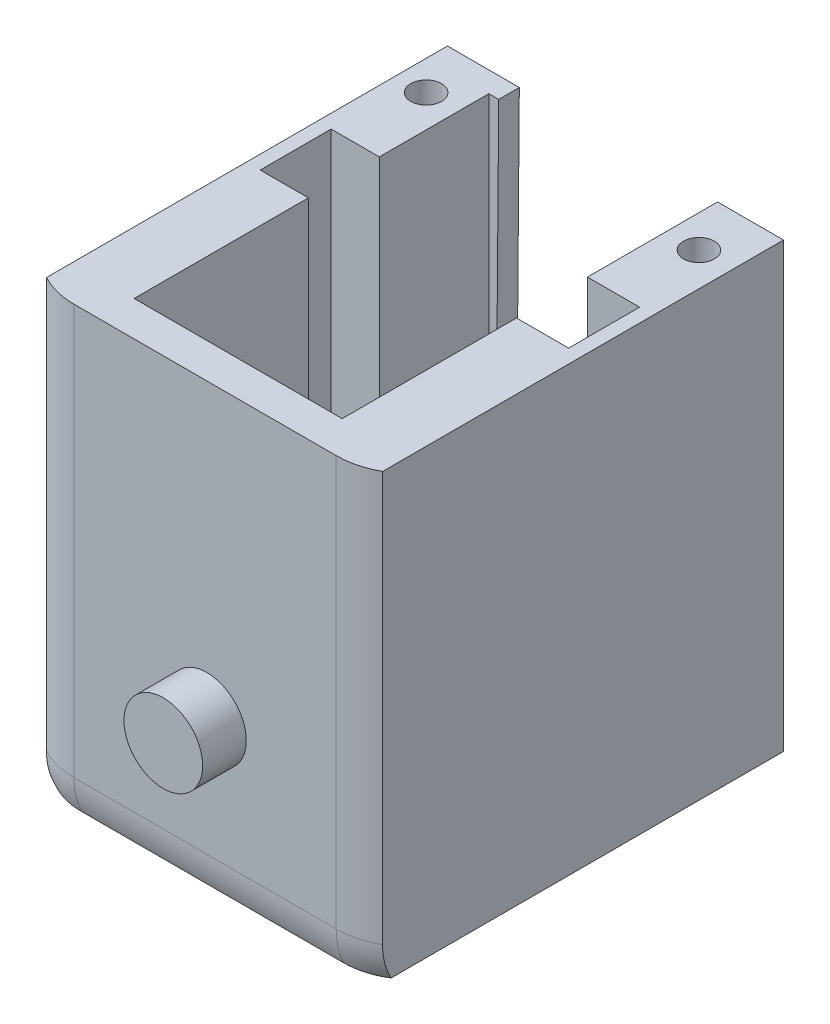
ISO-10303-21;
HEADER;
FILE_DESCRIPTION(('STEP AP214'),'2;1');
FILE_NAME('part.step','',(''),(''),'','','');
FILE_SCHEMA(('AUTOMOTIVE_DESIGN { 1 0 10303 214 1 1 1 1 }'));
ENDSEC;
DATA;
#1=APPLICATION_CONTEXT('core data for automotive mechanical design processes');
#2=APPLICATION_PROTOCOL_DEFINITION('international standard','automotive_design',2000,#1);
#3=PRODUCT_CONTEXT('',#1,'mechanical');
#4=PRODUCT('Part','Part','',(#3));
#5=PRODUCT_RELATED_PRODUCT_CATEGORY('part','',(#4));
#6=PRODUCT_DEFINITION_FORMATION('','',#4);
#7=PRODUCT_DEFINITION_CONTEXT('part definition',#1,'design');
#8=PRODUCT_DEFINITION('design','',#6,#7);
#9=PRODUCT_DEFINITION_SHAPE('','',#8);
#10=(LENGTH_UNIT() NAMED_UNIT(*) SI_UNIT(.MILLI.,.METRE.));
#11=(NAMED_UNIT(*) PLANE_ANGLE_UNIT() SI_UNIT($,.RADIAN.));
#12=(NAMED_UNIT(*) SI_UNIT($,.STERADIAN.) SOLID_ANGLE_UNIT());
#13=UNCERTAINTY_MEASURE_WITH_UNIT(LENGTH_MEASURE(1.E-05),#10,'distance_accuracy_value','');
#14=(GEOMETRIC_REPRESENTATION_CONTEXT(3) GLOBAL_UNCERTAINTY_ASSIGNED_CONTEXT((#13)) GLOBAL_UNIT_ASSIGNED_CONTEXT((#10,
#11,#12)) REPRESENTATION_CONTEXT('',''));
#15=CARTESIAN_POINT('',(0.,0.,0.));
#16=DIRECTION('',(0.,0.,1.));
#17=DIRECTION('',(1.,0.,0.));
#18=AXIS2_PLACEMENT_3D('',#15,#16,#17);
#19=CARTESIAN_POINT('',(13.6189073583087,13.8874822670605,-22.));
#20=DIRECTION('',(0.,0.,-1.));
#21=DIRECTION('',(-1.,0.,0.));
#22=AXIS2_PLACEMENT_3D('',#19,#20,#21);
#23=CYLINDRICAL_SURFACE('',#22,6.5);
#24=DIRECTION('',(0.,0.,-1.));
#25=VECTOR('',#24,1.);
#26=CARTESIAN_POINT('',(20.1189073583087,13.8874822670605,-19.6804961533153));
#27=LINE('',#26,#25);
#28=CARTESIAN_POINT('',(20.1189073583087,13.8874822670605,-28.3445213244936));
#29=VERTEX_POINT('',#28);
#30=CARTESIAN_POINT('',(20.1189073583087,13.8874822670605,-29.6804961533153));
#31=VERTEX_POINT('',#30);
#32=EDGE_CURVE('E232',#29,#31,#27,.T.);
#33=ORIENTED_EDGE('',*,*,#32,.T.);
#34=CARTESIAN_POINT('',(13.6189073583087,13.8874822670605,-29.6804961533153));
#35=DIRECTION('',(0.,0.,1.));
#36=DIRECTION('',(1.,0.,0.));
#37=AXIS2_PLACEMENT_3D('',#34,#35,#36);
#38=CIRCLE('',#37,6.5);
#39=CARTESIAN_POINT('',(17.25,8.49627032284471,-29.6804961533153));
#40=VERTEX_POINT('',#39);
#41=EDGE_CURVE('E256',#31,#40,#38,.F.);
#42=ORIENTED_EDGE('',*,*,#41,.T.);
#43=DIRECTION('',(0.,0.,-1.));
#44=VECTOR('',#43,1.);
#45=CARTESIAN_POINT('',(17.25,8.49627032284471,-22.));
#46=LINE('',#45,#44);
#47=CARTESIAN_POINT('',(17.25,8.49627032284471,-28.3445213244936));
#48=VERTEX_POINT('',#47);
#49=EDGE_CURVE('E356',#48,#40,#46,.T.);
#50=ORIENTED_EDGE('',*,*,#49,.F.);
#51=CARTESIAN_POINT('',(13.6189073583087,13.8874822670605,-28.3445213244936));
#52=DIRECTION('',(0.,0.,-1.));
#53=DIRECTION('',(-1.,0.,0.));
#54=AXIS2_PLACEMENT_3D('',#51,#52,#53);
#55=CIRCLE('',#54,6.5);
#56=EDGE_CURVE('E326',#29,#48,#55,.T.);
#57=ORIENTED_EDGE('',*,*,#56,.F.);
#58=EDGE_LOOP('',(#33,#42,#50,#57));
#59=FACE_BOUND('',#58,.T.);
#60=ADVANCED_FACE('F36',(#59),#23,.F.);
#61=CARTESIAN_POINT('',(23.5,1.58,-5.34452132449358));
#62=DIRECTION('',(1.,0.,0.));
#63=DIRECTION('',(0.,0.,-1.));
#64=AXIS2_PLACEMENT_3D('',#61,#62,#63);
#65=PLANE('',#64);
#66=DIRECTION('',(0.,1.,0.));
#67=VECTOR('',#66,1.);
#68=CARTESIAN_POINT('',(23.5,1.57999999999998,-21.2445213244936));
#69=LINE('',#68,#67);
#70=CARTESIAN_POINT('',(23.5,2.85882478392645,-21.2445213244936));
#71=VERTEX_POINT('',#70);
#72=CARTESIAN_POINT('',(23.5,31.58,-21.2445213244936));
#73=VERTEX_POINT('',#72);
#74=EDGE_CURVE('E288',#71,#73,#69,.T.);
#75=ORIENTED_EDGE('',*,*,#74,.F.);
#76=DIRECTION('',(0.,0.,1.));
#77=VECTOR('',#76,1.);
#78=CARTESIAN_POINT('',(23.5,2.85882478392645,-5.34452132449358));
#79=LINE('',#78,#77);
#80=CARTESIAN_POINT('',(23.5,2.85882478392645,-16.6445213244936));
#81=VERTEX_POINT('',#80);
#82=EDGE_CURVE('E429',#71,#81,#79,.T.);
#83=ORIENTED_EDGE('',*,*,#82,.T.);
#84=DIRECTION('',(0.,1.,0.));
#85=VECTOR('',#84,1.);
#86=CARTESIAN_POINT('',(23.5,1.57999999999998,-16.6445213244936));
#87=LINE('',#86,#85);
#88=CARTESIAN_POINT('',(23.5,31.58,-16.6445213244936));
#89=VERTEX_POINT('',#88);
#90=EDGE_CURVE('E278',#81,#89,#87,.T.);
#91=ORIENTED_EDGE('',*,*,#90,.T.);
#92=DIRECTION('',(0.,0.,-1.));
#93=VECTOR('',#92,1.);
#94=CARTESIAN_POINT('',(23.5,31.58,-5.34452132449358));
#95=LINE('',#94,#93);
#96=EDGE_CURVE('E349',#89,#73,#95,.T.);
#97=ORIENTED_EDGE('',*,*,#96,.T.);
#98=EDGE_LOOP('',(#75,#83,#91,#97));
#99=FACE_BOUND('',#98,.T.);
#100=ADVANCED_FACE('F494',(#99),#65,.F.);
#101=CARTESIAN_POINT('',(23.5,1.58,-28.3445213244936));
#102=DIRECTION('',(0.,0.,-1.));
#103=DIRECTION('',(-1.,0.,0.));
#104=AXIS2_PLACEMENT_3D('',#101,#102,#103);
#105=PLANE('',#104);
#106=CARTESIAN_POINT('',(9.75,8.66430738459447,-28.3445213244936));
#107=VERTEX_POINT('',#106);
#108=CARTESIAN_POINT('',(7.11980123180104,13.995276313233,-28.3445213244936));
#109=VERTEX_POINT('',#108);
#110=EDGE_CURVE('E330',#107,#109,#55,.T.);
#111=ORIENTED_EDGE('',*,*,#110,.T.);
#112=DIRECTION('',(0.00829213479200453,0.999965619659292,0.));
#113=VECTOR('',#112,1.);
#114=CARTESIAN_POINT('',(7.01798192082592,1.71667581451783,-28.3445213244936));
#115=LINE('',#114,#113);
#116=CARTESIAN_POINT('',(7.26562114423014,31.58,-28.3445213244936));
#117=VERTEX_POINT('',#116);
#118=EDGE_CURVE('E445',#109,#117,#115,.T.);
#119=ORIENTED_EDGE('',*,*,#118,.T.);
#120=DIRECTION('',(-1.,0.,0.));
#121=VECTOR('',#120,1.);
#122=CARTESIAN_POINT('',(23.5,31.58,-28.3445213244936));
#123=LINE('',#122,#121);
#124=CARTESIAN_POINT('',(6.625,31.58,-28.3445213244936));
#125=VERTEX_POINT('',#124);
#126=EDGE_CURVE('E231',#117,#125,#123,.T.);
#127=ORIENTED_EDGE('',*,*,#126,.T.);
#128=DIRECTION('',(0.,1.,0.));
#129=VECTOR('',#128,1.);
#130=CARTESIAN_POINT('',(6.625,1.57999999999998,-28.3445213244936));
#131=LINE('',#130,#129);
#132=CARTESIAN_POINT('',(6.62500000000001,2.85882478392645,-28.3445213244936));
#133=VERTEX_POINT('',#132);
#134=EDGE_CURVE('E304',#133,#125,#131,.T.);
#135=ORIENTED_EDGE('',*,*,#134,.F.);
#136=DIRECTION('',(1.,0.,0.));
#137=VECTOR('',#136,1.);
#138=CARTESIAN_POINT('',(23.5,2.85882478392645,-28.3445213244936));
#139=LINE('',#138,#137);
#140=CARTESIAN_POINT('',(20.1189073583087,2.85882478392645,-28.3445213244936));
#141=VERTEX_POINT('',#140);
#142=EDGE_CURVE('E413',#133,#141,#139,.T.);
#143=ORIENTED_EDGE('',*,*,#142,.T.);
#144=DIRECTION('',(0.,1.,0.));
#145=VECTOR('',#144,1.);
#146=CARTESIAN_POINT('',(20.1189073583087,1.57999999999998,-28.3445213244936));
#147=LINE('',#146,#145);
#148=EDGE_CURVE('E287',#141,#29,#147,.T.);
#149=ORIENTED_EDGE('',*,*,#148,.T.);
#150=ORIENTED_EDGE('',*,*,#56,.T.);
#151=DIRECTION('',(0.,1.,0.));
#152=VECTOR('',#151,1.);
#153=CARTESIAN_POINT('',(17.25,6.58,-28.3445213244936));
#154=LINE('',#153,#152);
#155=CARTESIAN_POINT('',(17.25,6.58,-28.3445213244936));
#156=VERTEX_POINT('',#155);
#157=EDGE_CURVE('E341',#156,#48,#154,.T.);
#158=ORIENTED_EDGE('',*,*,#157,.F.);
#159=DIRECTION('',(1.,0.,0.));
#160=VECTOR('',#159,1.);
#161=CARTESIAN_POINT('',(9.75,6.58,-28.3445213244936));
#162=LINE('',#161,#160);
#163=CARTESIAN_POINT('',(9.75,6.58,-28.3445213244936));
#164=VERTEX_POINT('',#163);
#165=EDGE_CURVE('E334',#164,#156,#162,.T.);
#166=ORIENTED_EDGE('',*,*,#165,.F.);
#167=DIRECTION('',(0.,1.,0.));
#168=VECTOR('',#167,1.);
#169=CARTESIAN_POINT('',(9.75,6.58,-28.3445213244936));
#170=LINE('',#169,#168);
#171=EDGE_CURVE('E340',#164,#107,#170,.T.);
#172=ORIENTED_EDGE('',*,*,#171,.T.);
#173=EDGE_LOOP('',(#111,#119,#127,#135,#143,#149,#150,#158,#166,#172));
#174=FACE_BOUND('',#173,.T.);
#175=ADVANCED_FACE('F501',(#174),#105,.F.);
#176=CARTESIAN_POINT('',(3.49999999999999,1.58,-28.3445213244936));
#177=DIRECTION('',(-1.,0.,0.));
#178=DIRECTION('',(0.,0.,1.));
#179=AXIS2_PLACEMENT_3D('',#176,#177,#178);
#180=PLANE('',#179);
#181=DIRECTION('',(0.,1.,0.));
#182=VECTOR('',#181,1.);
#183=CARTESIAN_POINT('',(3.5,1.57999999999998,-16.6445213244936));
#184=LINE('',#183,#182);
#185=CARTESIAN_POINT('',(3.5,2.85882478392645,-16.6445213244936));
#186=VERTEX_POINT('',#185);
#187=CARTESIAN_POINT('',(3.5,31.58,-16.6445213244936));
#188=VERTEX_POINT('',#187);
#189=EDGE_CURVE('E317',#186,#188,#184,.T.);
#190=ORIENTED_EDGE('',*,*,#189,.F.);
#191=DIRECTION('',(0.,0.,-1.));
#192=VECTOR('',#191,1.);
#193=CARTESIAN_POINT('',(3.49999999999999,2.85882478392645,-28.3445213244936));
#194=LINE('',#193,#192);
#195=CARTESIAN_POINT('',(3.49999999999999,2.85882478392645,-21.2445213244936));
#196=VERTEX_POINT('',#195);
#197=EDGE_CURVE('E416',#186,#196,#194,.T.);
#198=ORIENTED_EDGE('',*,*,#197,.T.);
#199=DIRECTION('',(0.,1.,0.));
#200=VECTOR('',#199,1.);
#201=CARTESIAN_POINT('',(3.49999999999999,1.57999999999998,-21.2445213244936));
#202=LINE('',#201,#200);
#203=CARTESIAN_POINT('',(3.49999999999999,31.58,-21.2445213244936));
#204=VERTEX_POINT('',#203);
#205=EDGE_CURVE('E301',#196,#204,#202,.T.);
#206=ORIENTED_EDGE('',*,*,#205,.T.);
#207=DIRECTION('',(0.,0.,1.));
#208=VECTOR('',#207,1.);
#209=CARTESIAN_POINT('',(3.49999999999999,31.58,-28.3445213244936));
#210=LINE('',#209,#208);
#211=EDGE_CURVE('E353',#204,#188,#210,.T.);
#212=ORIENTED_EDGE('',*,*,#211,.T.);
#213=EDGE_LOOP('',(#190,#198,#206,#212));
#214=FACE_BOUND('',#213,.T.);
#215=ADVANCED_FACE('F526',(#214),#180,.F.);
#216=CARTESIAN_POINT('',(3.5,1.58,-5.34452132449358));
#217=DIRECTION('',(0.,0.,1.));
#218=DIRECTION('',(1.,0.,0.));
#219=AXIS2_PLACEMENT_3D('',#216,#217,#218);
#220=PLANE('',#219);
#221=DIRECTION('',(0.,1.,0.));
#222=VECTOR('',#221,1.);
#223=CARTESIAN_POINT('',(20.1189073583087,1.57999999999998,-5.34452132449358));
#224=LINE('',#223,#222);
#225=CARTESIAN_POINT('',(20.1189073583087,2.85882478392645,-5.34452132449358));
#226=VERTEX_POINT('',#225);
#227=CARTESIAN_POINT('',(20.1189073583087,31.58,-5.34452132449358));
#228=VERTEX_POINT('',#227);
#229=EDGE_CURVE('E280',#226,#228,#224,.T.);
#230=ORIENTED_EDGE('',*,*,#229,.F.);
#231=DIRECTION('',(-1.,0.,0.));
#232=VECTOR('',#231,1.);
#233=CARTESIAN_POINT('',(3.5,2.85882478392645,-5.34452132449358));
#234=LINE('',#233,#232);
#235=CARTESIAN_POINT('',(6.625,2.85882478392645,-5.34452132449358));
#236=VERTEX_POINT('',#235);
#237=EDGE_CURVE('E432',#226,#236,#234,.T.);
#238=ORIENTED_EDGE('',*,*,#237,.T.);
#239=DIRECTION('',(0.,1.,0.));
#240=VECTOR('',#239,1.);
#241=CARTESIAN_POINT('',(6.625,1.57999999999998,-5.34452132449358));
#242=LINE('',#241,#240);
#243=CARTESIAN_POINT('',(6.625,31.58,-5.34452132449358));
#244=VERTEX_POINT('',#243);
#245=EDGE_CURVE('E314',#236,#244,#242,.T.);
#246=ORIENTED_EDGE('',*,*,#245,.T.);
#247=DIRECTION('',(1.,0.,0.));
#248=VECTOR('',#247,1.);
#249=CARTESIAN_POINT('',(3.5,31.58,-5.34452132449358));
#250=LINE('',#249,#248);
#251=EDGE_CURVE('E344',#244,#228,#250,.T.);
#252=ORIENTED_EDGE('',*,*,#251,.T.);
#253=EDGE_LOOP('',(#230,#238,#246,#252));
#254=FACE_BOUND('',#253,.T.);
#255=ADVANCED_FACE('F523',(#254),#220,.F.);
#256=CARTESIAN_POINT('',(17.25,6.58,-32.));
#257=DIRECTION('',(1.,0.,0.));
#258=DIRECTION('',(0.,0.,-1.));
#259=AXIS2_PLACEMENT_3D('',#256,#257,#258);
#260=PLANE('',#259);
#261=ORIENTED_EDGE('',*,*,#49,.T.);
#262=DIRECTION('',(0.,-1.,0.));
#263=VECTOR('',#262,1.);
#264=CARTESIAN_POINT('',(17.25,6.58,-29.6804961533153));
#265=LINE('',#264,#263);
#266=CARTESIAN_POINT('',(17.25,6.58,-29.6804961533153));
#267=VERTEX_POINT('',#266);
#268=EDGE_CURVE('E253',#40,#267,#265,.T.);
#269=ORIENTED_EDGE('',*,*,#268,.T.);
#270=DIRECTION('',(0.,0.,-1.));
#271=VECTOR('',#270,1.);
#272=CARTESIAN_POINT('',(17.25,6.58,-32.));
#273=LINE('',#272,#271);
#274=EDGE_CURVE('E337',#156,#267,#273,.T.);
#275=ORIENTED_EDGE('',*,*,#274,.F.);
#276=ORIENTED_EDGE('',*,*,#157,.T.);
#277=EDGE_LOOP('',(#261,#269,#275,#276));
#278=FACE_BOUND('',#277,.T.);
#279=ADVANCED_FACE('F476',(#278),#260,.F.);
#280=CARTESIAN_POINT('',(0.,31.58,0.));
#281=DIRECTION('',(0.,-1.,0.));
#282=DIRECTION('',(0.,0.,-1.));
#283=AXIS2_PLACEMENT_3D('',#280,#281,#282);
#284=PLANE('',#283);
#285=CARTESIAN_POINT('',(4.525,31.58,-26.3754221590893));
#286=DIRECTION('',(0.,1.,0.));
#287=DIRECTION('',(0.,0.,1.));
#288=AXIS2_PLACEMENT_3D('',#285,#286,#287);
#289=CIRCLE('',#288,1.);
#290=CARTESIAN_POINT('',(4.525,31.58,-25.3754221590893));
#291=VERTEX_POINT('',#290);
#292=EDGE_CURVE('E458',#291,#291,#289,.T.);
#293=ORIENTED_EDGE('',*,*,#292,.F.);
#294=EDGE_LOOP('',(#293));
#295=FACE_BOUND('',#294,.T.);
#296=CARTESIAN_POINT('',(22.2189073583087,31.58,-26.3754221590893));
#297=DIRECTION('',(0.,1.,0.));
#298=DIRECTION('',(0.,0.,1.));
#299=AXIS2_PLACEMENT_3D('',#296,#297,#298);
#300=CIRCLE('',#299,0.999999999999998);
#301=CARTESIAN_POINT('',(22.2189073583087,31.58,-25.3754221590893));
#302=VERTEX_POINT('',#301);
#303=EDGE_CURVE('E452',#302,#302,#300,.T.);
#304=ORIENTED_EDGE('',*,*,#303,.F.);
#305=EDGE_LOOP('',(#304));
#306=FACE_BOUND('',#305,.T.);
#307=DIRECTION('',(1.,0.,0.));
#308=VECTOR('',#307,1.);
#309=CARTESIAN_POINT('',(2.60580673295634,31.58,-29.6804961533153));
#310=LINE('',#309,#308);
#311=CARTESIAN_POINT('',(20.1189073583087,31.58,-29.6804961533153));
#312=VERTEX_POINT('',#311);
#313=CARTESIAN_POINT('',(24.3941932670437,31.58,-29.6804961533153));
#314=VERTEX_POINT('',#313);
#315=EDGE_CURVE('E240',#312,#314,#310,.T.);
#316=ORIENTED_EDGE('',*,*,#315,.F.);
#317=DIRECTION('',(0.,0.,1.));
#318=VECTOR('',#317,1.);
#319=CARTESIAN_POINT('',(20.1189073583087,31.58,0.));
#320=LINE('',#319,#318);
#321=CARTESIAN_POINT('',(20.1189073583087,31.58,-21.2445213244936));
#322=VERTEX_POINT('',#321);
#323=EDGE_CURVE('E51',#312,#322,#320,.T.);
#324=ORIENTED_EDGE('',*,*,#323,.T.);
#325=DIRECTION('',(-1.,0.,0.));
#326=VECTOR('',#325,1.);
#327=CARTESIAN_POINT('',(0.,31.58,-21.2445213244936));
#328=LINE('',#327,#326);
#329=EDGE_CURVE('E284',#73,#322,#328,.T.);
#330=ORIENTED_EDGE('',*,*,#329,.F.);
#331=ORIENTED_EDGE('',*,*,#96,.F.);
#332=DIRECTION('',(1.,0.,0.));
#333=VECTOR('',#332,1.);
#334=CARTESIAN_POINT('',(0.,31.58,-16.6445213244936));
#335=LINE('',#334,#333);
#336=CARTESIAN_POINT('',(20.1189073583087,31.58,-16.6445213244936));
#337=VERTEX_POINT('',#336);
#338=EDGE_CURVE('E271',#337,#89,#335,.T.);
#339=ORIENTED_EDGE('',*,*,#338,.F.);
#340=DIRECTION('',(0.,0.,1.));
#341=VECTOR('',#340,1.);
#342=CARTESIAN_POINT('',(20.1189073583087,31.58,0.));
#343=LINE('',#342,#341);
#344=EDGE_CURVE('E274',#337,#228,#343,.T.);
#345=ORIENTED_EDGE('',*,*,#344,.T.);
#346=ORIENTED_EDGE('',*,*,#251,.F.);
#347=DIRECTION('',(0.,0.,1.));
#348=VECTOR('',#347,1.);
#349=CARTESIAN_POINT('',(6.625,31.58,0.));
#350=LINE('',#349,#348);
#351=CARTESIAN_POINT('',(6.625,31.58,-16.6445213244936));
#352=VERTEX_POINT('',#351);
#353=EDGE_CURVE('E303',#352,#244,#350,.T.);
#354=ORIENTED_EDGE('',*,*,#353,.F.);
#355=DIRECTION('',(-1.,0.,0.));
#356=VECTOR('',#355,1.);
#357=CARTESIAN_POINT('',(0.,31.58,-16.6445213244936));
#358=LINE('',#357,#356);
#359=EDGE_CURVE('E310',#352,#188,#358,.T.);
#360=ORIENTED_EDGE('',*,*,#359,.T.);
#361=ORIENTED_EDGE('',*,*,#211,.F.);
#362=DIRECTION('',(-1.,0.,0.));
#363=VECTOR('',#362,1.);
#364=CARTESIAN_POINT('',(0.,31.58,-21.2445213244936));
#365=LINE('',#364,#363);
#366=CARTESIAN_POINT('',(6.625,31.58,-21.2445213244936));
#367=VERTEX_POINT('',#366);
#368=EDGE_CURVE('E290',#367,#204,#365,.T.);
#369=ORIENTED_EDGE('',*,*,#368,.F.);
#370=DIRECTION('',(0.,0.,1.));
#371=VECTOR('',#370,1.);
#372=CARTESIAN_POINT('',(6.625,31.58,0.));
#373=LINE('',#372,#371);
#374=EDGE_CURVE('E297',#125,#367,#373,.T.);
#375=ORIENTED_EDGE('',*,*,#374,.F.);
#376=ORIENTED_EDGE('',*,*,#126,.F.);
#377=DIRECTION('',(0.,0.,-1.));
#378=VECTOR('',#377,1.);
#379=CARTESIAN_POINT('',(7.26562114423014,31.58,-19.6804961533153));
#380=LINE('',#379,#378);
#381=CARTESIAN_POINT('',(7.26562114423014,31.58,-29.6804961533153));
#382=VERTEX_POINT('',#381);
#383=EDGE_CURVE('E217',#117,#382,#380,.T.);
#384=ORIENTED_EDGE('',*,*,#383,.T.);
#385=CARTESIAN_POINT('',(2.60580673295634,31.58,-29.6804961533153));
#386=VERTEX_POINT('',#385);
#387=EDGE_CURVE('E228',#386,#382,#310,.T.);
#388=ORIENTED_EDGE('',*,*,#387,.F.);
#389=DIRECTION('',(0.,0.,-1.));
#390=VECTOR('',#389,1.);
#391=CARTESIAN_POINT('',(2.60580673295634,31.58,-32.));
#392=LINE('',#391,#390);
#393=CARTESIAN_POINT('',(2.60580673295634,31.58,-3.68304406071566));
#394=VERTEX_POINT('',#393);
#395=EDGE_CURVE('E259',#394,#386,#392,.T.);
#396=ORIENTED_EDGE('',*,*,#395,.F.);
#397=CARTESIAN_POINT('',(5.,31.58,-8.07255868081237));
#398=DIRECTION('',(0.,-1.,0.));
#399=DIRECTION('',(0.,0.,-1.));
#400=AXIS2_PLACEMENT_3D('',#397,#398,#399);
#401=CIRCLE('',#400,5.);
#402=CARTESIAN_POINT('',(5.,31.58,-3.07255868081237));
#403=VERTEX_POINT('',#402);
#404=EDGE_CURVE('E370',#394,#403,#401,.F.);
#405=ORIENTED_EDGE('',*,*,#404,.T.);
#406=DIRECTION('',(-1.,0.,0.));
#407=VECTOR('',#406,1.);
#408=CARTESIAN_POINT('',(0.,31.58,-3.07255868081237));
#409=LINE('',#408,#407);
#410=CARTESIAN_POINT('',(22.,31.58,-3.07255868081237));
#411=VERTEX_POINT('',#410);
#412=EDGE_CURVE('E323',#411,#403,#409,.T.);
#413=ORIENTED_EDGE('',*,*,#412,.F.);
#414=CARTESIAN_POINT('',(22.,31.58,-8.07255868081237));
#415=DIRECTION('',(0.,-1.,0.));
#416=DIRECTION('',(0.,0.,-1.));
#417=AXIS2_PLACEMENT_3D('',#414,#415,#416);
#418=CIRCLE('',#417,5.);
#419=CARTESIAN_POINT('',(24.3941932670437,31.58,-3.68304406071565));
#420=VERTEX_POINT('',#419);
#421=EDGE_CURVE('E367',#411,#420,#418,.F.);
#422=ORIENTED_EDGE('',*,*,#421,.T.);
#423=DIRECTION('',(0.,0.,1.));
#424=VECTOR('',#423,1.);
#425=CARTESIAN_POINT('',(24.3941932670437,31.58,-18.5101827804249));
#426=LINE('',#425,#424);
#427=EDGE_CURVE('E258',#314,#420,#426,.T.);
#428=ORIENTED_EDGE('',*,*,#427,.F.);
#429=EDGE_LOOP('',(#316,#324,#330,#331,#339,#345,#346,#354,#360,#361,#369,#375,#376,#384,#388,
#396,#405,#413,#422,#428));
#430=FACE_BOUND('',#429,.T.);
#431=ADVANCED_FACE('F226',(#295,#306,#430),#284,.F.);
#432=CARTESIAN_POINT('',(9.75,6.58,-32.));
#433=DIRECTION('',(-1.,0.,0.));
#434=DIRECTION('',(0.,0.,1.));
#435=AXIS2_PLACEMENT_3D('',#432,#433,#434);
#436=PLANE('',#435);
#437=DIRECTION('',(0.,0.,1.));
#438=VECTOR('',#437,1.);
#439=CARTESIAN_POINT('',(9.75,6.58,-32.));
#440=LINE('',#439,#438);
#441=CARTESIAN_POINT('',(9.75,6.58,-29.6804961533153));
#442=VERTEX_POINT('',#441);
#443=EDGE_CURVE('E332',#442,#164,#440,.T.);
#444=ORIENTED_EDGE('',*,*,#443,.F.);
#445=DIRECTION('',(0.,1.,0.));
#446=VECTOR('',#445,1.);
#447=CARTESIAN_POINT('',(9.75,6.58,-29.6804961533153));
#448=LINE('',#447,#446);
#449=CARTESIAN_POINT('',(9.75,8.66430738459447,-29.6804961533153));
#450=VERTEX_POINT('',#449);
#451=EDGE_CURVE('E248',#442,#450,#448,.T.);
#452=ORIENTED_EDGE('',*,*,#451,.T.);
#453=DIRECTION('',(0.,0.,-1.));
#454=VECTOR('',#453,1.);
#455=CARTESIAN_POINT('',(9.75,8.66430738459447,-22.));
#456=LINE('',#455,#454);
#457=EDGE_CURVE('E329',#450,#107,#456,.F.);
#458=ORIENTED_EDGE('',*,*,#457,.T.);
#459=ORIENTED_EDGE('',*,*,#171,.F.);
#460=EDGE_LOOP('',(#444,#452,#458,#459));
#461=FACE_BOUND('',#460,.T.);
#462=ADVANCED_FACE('F475',(#461),#436,.F.);
#463=CARTESIAN_POINT('',(0.,6.58,0.));
#464=DIRECTION('',(0.,1.,0.));
#465=DIRECTION('',(0.,0.,1.));
#466=AXIS2_PLACEMENT_3D('',#463,#464,#465);
#467=PLANE('',#466);
#468=DIRECTION('',(1.,0.,0.));
#469=VECTOR('',#468,1.);
#470=CARTESIAN_POINT('',(0.,6.58,-29.6804961533153));
#471=LINE('',#470,#469);
#472=EDGE_CURVE('E251',#442,#267,#471,.T.);
#473=ORIENTED_EDGE('',*,*,#472,.F.);
#474=ORIENTED_EDGE('',*,*,#443,.T.);
#475=ORIENTED_EDGE('',*,*,#165,.T.);
#476=ORIENTED_EDGE('',*,*,#274,.T.);
#477=EDGE_LOOP('',(#473,#474,#475,#476));
#478=FACE_BOUND('',#477,.T.);
#479=ADVANCED_FACE('F508',(#478),#467,.T.);
#480=CARTESIAN_POINT('',(13.6189073583087,13.8874822670605,-29.6804961533153));
#481=DIRECTION('',(0.,0.,1.));
#482=DIRECTION('',(1.,0.,0.));
#483=AXIS2_PLACEMENT_3D('',#480,#481,#482);
#484=CIRCLE('',#483,6.5);
#485=CARTESIAN_POINT('',(7.11980123180104,13.9952763132332,-29.6804961533153));
#486=VERTEX_POINT('',#485);
#487=EDGE_CURVE('E59',#450,#486,#484,.F.);
#488=ORIENTED_EDGE('',*,*,#487,.T.);
#489=DIRECTION('',(0.,0.,-1.));
#490=VECTOR('',#489,1.);
#491=CARTESIAN_POINT('',(7.11980123180104,13.995276313233,-22.));
#492=LINE('',#491,#490);
#493=EDGE_CURVE('E219',#486,#109,#492,.F.);
#494=ORIENTED_EDGE('',*,*,#493,.T.);
#495=ORIENTED_EDGE('',*,*,#110,.F.);
#496=ORIENTED_EDGE('',*,*,#457,.F.);
#497=EDGE_LOOP('',(#488,#494,#495,#496));
#498=FACE_BOUND('',#497,.T.);
#499=ADVANCED_FACE('F497',(#498),#23,.F.);
#500=CARTESIAN_POINT('',(0.,0.,-3.07255868081237));
#501=DIRECTION('',(0.,0.,-1.));
#502=DIRECTION('',(-1.,0.,0.));
#503=AXIS2_PLACEMENT_3D('',#500,#501,#502);
#504=PLANE('',#503);
#505=CARTESIAN_POINT('',(13.6189073583087,12.657,-3.07255868081237));
#506=DIRECTION('',(0.,0.,-1.));
#507=DIRECTION('',(-1.,0.,0.));
#508=AXIS2_PLACEMENT_3D('',#505,#506,#507);
#509=CIRCLE('',#508,2.55);
#510=CARTESIAN_POINT('',(11.0689073583087,12.657,-3.07255868081237));
#511=VERTEX_POINT('',#510);
#512=EDGE_CURVE('E372',#511,#511,#509,.F.);
#513=ORIENTED_EDGE('',*,*,#512,.F.);
#514=EDGE_LOOP('',(#513));
#515=FACE_BOUND('',#514,.T.);
#516=ORIENTED_EDGE('',*,*,#412,.T.);
#517=DIRECTION('',(0.,1.,0.));
#518=VECTOR('',#517,1.);
#519=CARTESIAN_POINT('',(5.,0.,-3.07255868081237));
#520=LINE('',#519,#518);
#521=CARTESIAN_POINT('',(5.,5.,-3.07255868081237));
#522=VERTEX_POINT('',#521);
#523=EDGE_CURVE('E364',#403,#522,#520,.F.);
#524=ORIENTED_EDGE('',*,*,#523,.T.);
#525=DIRECTION('',(-1.,0.,0.));
#526=VECTOR('',#525,1.);
#527=CARTESIAN_POINT('',(27.,5.,-3.07255868081237));
#528=LINE('',#527,#526);
#529=CARTESIAN_POINT('',(22.,5.,-3.07255868081237));
#530=VERTEX_POINT('',#529);
#531=EDGE_CURVE('E361',#522,#530,#528,.F.);
#532=ORIENTED_EDGE('',*,*,#531,.T.);
#533=DIRECTION('',(0.,1.,0.));
#534=VECTOR('',#533,1.);
#535=CARTESIAN_POINT('',(22.,0.,-3.07255868081237));
#536=LINE('',#535,#534);
#537=EDGE_CURVE('E359',#530,#411,#536,.T.);
#538=ORIENTED_EDGE('',*,*,#537,.T.);
#539=EDGE_LOOP('',(#516,#524,#532,#538));
#540=FACE_BOUND('',#539,.T.);
#541=ADVANCED_FACE('F507',(#515,#540),#504,.F.);
#542=CARTESIAN_POINT('',(22.,0.,-8.07255868081237));
#543=DIRECTION('',(0.,1.,0.));
#544=DIRECTION('',(0.,0.,1.));
#545=AXIS2_PLACEMENT_3D('',#542,#543,#544);
#546=CYLINDRICAL_SURFACE('',#545,5.);
#547=DIRECTION('',(0.,1.,0.));
#548=VECTOR('',#547,1.);
#549=CARTESIAN_POINT('',(24.3941932670437,0.,-3.68304406071565));
#550=LINE('',#549,#548);
#551=CARTESIAN_POINT('',(24.3941932670437,5.,-3.68304406071565));
#552=VERTEX_POINT('',#551);
#553=EDGE_CURVE('E269',#420,#552,#550,.F.);
#554=ORIENTED_EDGE('',*,*,#553,.F.);
#555=ORIENTED_EDGE('',*,*,#421,.F.);
#556=ORIENTED_EDGE('',*,*,#537,.F.);
#557=CARTESIAN_POINT('',(22.,5.,-8.07255868081237));
#558=DIRECTION('',(0.,-1.,0.));
#559=DIRECTION('',(0.,0.,-1.));
#560=AXIS2_PLACEMENT_3D('',#557,#558,#559);
#561=CIRCLE('',#560,5.);
#562=EDGE_CURVE('E377',#552,#530,#561,.T.);
#563=ORIENTED_EDGE('',*,*,#562,.F.);
#564=EDGE_LOOP('',(#554,#555,#556,#563));
#565=FACE_BOUND('',#564,.T.);
#566=ADVANCED_FACE('F38',(#565),#546,.T.);
#567=CARTESIAN_POINT('',(5.,31.58,-8.07255868081237));
#568=DIRECTION('',(0.,1.,0.));
#569=DIRECTION('',(0.,0.,1.));
#570=AXIS2_PLACEMENT_3D('',#567,#568,#569);
#571=CYLINDRICAL_SURFACE('',#570,5.);
#572=DIRECTION('',(0.,1.,0.));
#573=VECTOR('',#572,1.);
#574=CARTESIAN_POINT('',(2.60580673295634,0.,-3.68304406071566));
#575=LINE('',#574,#573);
#576=CARTESIAN_POINT('',(2.60580673295634,5.,-3.68304406071566));
#577=VERTEX_POINT('',#576);
#578=EDGE_CURVE('E261',#577,#394,#575,.T.);
#579=ORIENTED_EDGE('',*,*,#578,.F.);
#580=CARTESIAN_POINT('',(5.,5.,-8.07255868081237));
#581=DIRECTION('',(0.,-1.,0.));
#582=DIRECTION('',(1.,0.,0.));
#583=AXIS2_PLACEMENT_3D('',#580,#581,#582);
#584=CIRCLE('',#583,5.);
#585=EDGE_CURVE('E374',#522,#577,#584,.T.);
#586=ORIENTED_EDGE('',*,*,#585,.F.);
#587=ORIENTED_EDGE('',*,*,#523,.F.);
#588=ORIENTED_EDGE('',*,*,#404,.F.);
#589=EDGE_LOOP('',(#579,#586,#587,#588));
#590=FACE_BOUND('',#589,.T.);
#591=ADVANCED_FACE('F545',(#590),#571,.T.);
#592=CARTESIAN_POINT('',(0.,5.,-8.07255868081237));
#593=DIRECTION('',(1.,0.,0.));
#594=DIRECTION('',(0.,0.,-1.));
#595=AXIS2_PLACEMENT_3D('',#592,#593,#594);
#596=CYLINDRICAL_SURFACE('',#595,5.);
#597=DIRECTION('',(1.,0.,0.));
#598=VECTOR('',#597,1.);
#599=CARTESIAN_POINT('',(0.,2.85882478392645,-3.55422174184108));
#600=LINE('',#599,#598);
#601=CARTESIAN_POINT('',(22.,2.85882478392645,-3.55422174184108));
#602=VERTEX_POINT('',#601);
#603=CARTESIAN_POINT('',(5.,2.85882478392645,-3.55422174184108));
#604=VERTEX_POINT('',#603);
#605=EDGE_CURVE('E402',#602,#604,#600,.F.);
#606=ORIENTED_EDGE('',*,*,#605,.F.);
#607=CARTESIAN_POINT('',(22.,5.,-8.07255868081237));
#608=DIRECTION('',(1.,0.,0.));
#609=DIRECTION('',(0.,0.,-1.));
#610=AXIS2_PLACEMENT_3D('',#607,#608,#609);
#611=CIRCLE('',#610,5.);
#612=EDGE_CURVE('E327',#530,#602,#611,.T.);
#613=ORIENTED_EDGE('',*,*,#612,.F.);
#614=ORIENTED_EDGE('',*,*,#531,.F.);
#615=CARTESIAN_POINT('',(5.,5.,-8.07255868081237));
#616=DIRECTION('',(-1.,0.,0.));
#617=DIRECTION('',(0.,0.,1.));
#618=AXIS2_PLACEMENT_3D('',#615,#616,#617);
#619=CIRCLE('',#618,5.);
#620=EDGE_CURVE('E322',#604,#522,#619,.T.);
#621=ORIENTED_EDGE('',*,*,#620,.F.);
#622=EDGE_LOOP('',(#606,#613,#614,#621));
#623=FACE_BOUND('',#622,.T.);
#624=ADVANCED_FACE('F543',(#623),#596,.T.);
#625=CARTESIAN_POINT('',(22.,5.,-8.07255868081237));
#626=DIRECTION('',(0.,0.,1.));
#627=DIRECTION('',(1.,0.,0.));
#628=AXIS2_PLACEMENT_3D('',#625,#626,#627);
#629=SPHERICAL_SURFACE('',#628,5.);
#630=CARTESIAN_POINT('',(22.,2.85882478392645,-8.07255868081237));
#631=DIRECTION('',(0.,1.,0.));
#632=DIRECTION('',(0.,0.,1.));
#633=AXIS2_PLACEMENT_3D('',#630,#631,#632);
#634=CIRCLE('',#633,4.51833693897128);
#635=CARTESIAN_POINT('',(24.3941932670437,2.85882478392645,-4.24069134306237));
#636=VERTEX_POINT('',#635);
#637=EDGE_CURVE('E243',#636,#602,#634,.F.);
#638=ORIENTED_EDGE('',*,*,#637,.F.);
#639=CARTESIAN_POINT('',(24.3941932670437,5.,-8.07255868081237));
#640=DIRECTION('',(-1.,0.,0.));
#641=DIRECTION('',(0.,0.,1.));
#642=AXIS2_PLACEMENT_3D('',#639,#640,#641);
#643=CIRCLE('',#642,4.38951462009672);
#644=EDGE_CURVE('E266',#552,#636,#643,.F.);
#645=ORIENTED_EDGE('',*,*,#644,.F.);
#646=ORIENTED_EDGE('',*,*,#562,.T.);
#647=ORIENTED_EDGE('',*,*,#612,.T.);
#648=EDGE_LOOP('',(#638,#645,#646,#647));
#649=FACE_BOUND('',#648,.T.);
#650=ADVANCED_FACE('F399',(#649),#629,.T.);
#651=CARTESIAN_POINT('',(5.,5.,-8.07255868081237));
#652=DIRECTION('',(0.,0.,1.));
#653=DIRECTION('',(1.,0.,0.));
#654=AXIS2_PLACEMENT_3D('',#651,#652,#653);
#655=SPHERICAL_SURFACE('',#654,5.);
#656=CARTESIAN_POINT('',(5.,2.85882478392645,-8.07255868081237));
#657=DIRECTION('',(0.,1.,0.));
#658=DIRECTION('',(0.,0.,1.));
#659=AXIS2_PLACEMENT_3D('',#656,#657,#658);
#660=CIRCLE('',#659,4.51833693897128);
#661=CARTESIAN_POINT('',(2.60580673295634,2.85882478392645,-4.24069134306238));
#662=VERTEX_POINT('',#661);
#663=EDGE_CURVE('E403',#604,#662,#660,.F.);
#664=ORIENTED_EDGE('',*,*,#663,.F.);
#665=ORIENTED_EDGE('',*,*,#620,.T.);
#666=ORIENTED_EDGE('',*,*,#585,.T.);
#667=CARTESIAN_POINT('',(2.60580673295634,5.,-8.07255868081237));
#668=DIRECTION('',(1.,0.,0.));
#669=DIRECTION('',(0.,0.,-1.));
#670=AXIS2_PLACEMENT_3D('',#667,#668,#669);
#671=CIRCLE('',#670,4.38951462009671);
#672=EDGE_CURVE('E263',#662,#577,#671,.F.);
#673=ORIENTED_EDGE('',*,*,#672,.F.);
#674=EDGE_LOOP('',(#664,#665,#666,#673));
#675=FACE_BOUND('',#674,.T.);
#676=ADVANCED_FACE('F536',(#675),#655,.T.);
#677=CARTESIAN_POINT('',(13.6189073583087,12.657,-0.242558680812367));
#678=DIRECTION('',(0.,0.,-1.));
#679=DIRECTION('',(-1.,0.,0.));
#680=AXIS2_PLACEMENT_3D('',#677,#678,#679);
#681=CYLINDRICAL_SURFACE('',#680,2.55);
#682=CARTESIAN_POINT('',(13.6189073583087,12.657,-0.242558680812367));
#683=DIRECTION('',(0.,0.,1.));
#684=DIRECTION('',(1.,0.,0.));
#685=AXIS2_PLACEMENT_3D('',#682,#683,#684);
#686=CIRCLE('',#685,2.55);
#687=CARTESIAN_POINT('',(16.1689073583087,12.657,-0.242558680812367));
#688=VERTEX_POINT('',#687);
#689=EDGE_CURVE('E316',#688,#688,#686,.T.);
#690=ORIENTED_EDGE('',*,*,#689,.F.);
#691=EDGE_LOOP('',(#690));
#692=FACE_BOUND('',#691,.T.);
#693=ORIENTED_EDGE('',*,*,#512,.T.);
#694=EDGE_LOOP('',(#693));
#695=FACE_BOUND('',#694,.T.);
#696=ADVANCED_FACE('F539',(#692,#695),#681,.T.);
#697=CARTESIAN_POINT('',(13.6189073583087,12.657,-0.242558680812367));
#698=DIRECTION('',(0.,0.,1.));
#699=DIRECTION('',(1.,0.,0.));
#700=AXIS2_PLACEMENT_3D('',#697,#698,#699);
#701=PLANE('',#700);
#702=ORIENTED_EDGE('',*,*,#689,.T.);
#703=EDGE_LOOP('',(#702));
#704=FACE_BOUND('',#703,.T.);
#705=ADVANCED_FACE('F603',(#704),#701,.T.);
#706=CARTESIAN_POINT('',(6.625,1.57999999999998,0.));
#707=DIRECTION('',(-1.,0.,0.));
#708=DIRECTION('',(0.,0.,1.));
#709=AXIS2_PLACEMENT_3D('',#706,#707,#708);
#710=PLANE('',#709);
#711=ORIENTED_EDGE('',*,*,#245,.F.);
#712=DIRECTION('',(0.,0.,-1.));
#713=VECTOR('',#712,1.);
#714=CARTESIAN_POINT('',(6.625,2.85882478392645,0.));
#715=LINE('',#714,#713);
#716=CARTESIAN_POINT('',(6.625,2.85882478392645,-16.6445213244936));
#717=VERTEX_POINT('',#716);
#718=EDGE_CURVE('E423',#236,#717,#715,.T.);
#719=ORIENTED_EDGE('',*,*,#718,.T.);
#720=DIRECTION('',(0.,1.,0.));
#721=VECTOR('',#720,1.);
#722=CARTESIAN_POINT('',(6.625,1.57999999999998,-16.6445213244936));
#723=LINE('',#722,#721);
#724=EDGE_CURVE('E313',#717,#352,#723,.T.);
#725=ORIENTED_EDGE('',*,*,#724,.T.);
#726=ORIENTED_EDGE('',*,*,#353,.T.);
#727=EDGE_LOOP('',(#711,#719,#725,#726));
#728=FACE_BOUND('',#727,.T.);
#729=ADVANCED_FACE('F599',(#728),#710,.F.);
#730=CARTESIAN_POINT('',(0.,1.57999999999998,-16.6445213244936));
#731=DIRECTION('',(0.,0.,-1.));
#732=DIRECTION('',(-1.,0.,0.));
#733=AXIS2_PLACEMENT_3D('',#730,#731,#732);
#734=PLANE('',#733);
#735=DIRECTION('',(1.,0.,0.));
#736=VECTOR('',#735,1.);
#737=CARTESIAN_POINT('',(0.,2.85882478392645,-16.6445213244936));
#738=LINE('',#737,#736);
#739=EDGE_CURVE('E419',#186,#717,#738,.T.);
#740=ORIENTED_EDGE('',*,*,#739,.F.);
#741=ORIENTED_EDGE('',*,*,#189,.T.);
#742=ORIENTED_EDGE('',*,*,#359,.F.);
#743=ORIENTED_EDGE('',*,*,#724,.F.);
#744=EDGE_LOOP('',(#740,#741,#742,#743));
#745=FACE_BOUND('',#744,.T.);
#746=ADVANCED_FACE('F595',(#745),#734,.T.);
#747=CARTESIAN_POINT('',(0.,1.57999999999998,-21.2445213244936));
#748=DIRECTION('',(0.,0.,-1.));
#749=DIRECTION('',(-1.,0.,0.));
#750=AXIS2_PLACEMENT_3D('',#747,#748,#749);
#751=PLANE('',#750);
#752=ORIENTED_EDGE('',*,*,#205,.F.);
#753=DIRECTION('',(1.,0.,0.));
#754=VECTOR('',#753,1.);
#755=CARTESIAN_POINT('',(0.,2.85882478392645,-21.2445213244936));
#756=LINE('',#755,#754);
#757=CARTESIAN_POINT('',(6.625,2.85882478392645,-21.2445213244936));
#758=VERTEX_POINT('',#757);
#759=EDGE_CURVE('E405',#196,#758,#756,.T.);
#760=ORIENTED_EDGE('',*,*,#759,.T.);
#761=DIRECTION('',(0.,1.,0.));
#762=VECTOR('',#761,1.);
#763=CARTESIAN_POINT('',(6.625,1.57999999999998,-21.2445213244936));
#764=LINE('',#763,#762);
#765=EDGE_CURVE('E300',#758,#367,#764,.T.);
#766=ORIENTED_EDGE('',*,*,#765,.T.);
#767=ORIENTED_EDGE('',*,*,#368,.T.);
#768=EDGE_LOOP('',(#752,#760,#766,#767));
#769=FACE_BOUND('',#768,.T.);
#770=ADVANCED_FACE('F591',(#769),#751,.F.);
#771=CARTESIAN_POINT('',(6.625,1.57999999999998,0.));
#772=DIRECTION('',(-1.,0.,0.));
#773=DIRECTION('',(0.,0.,1.));
#774=AXIS2_PLACEMENT_3D('',#771,#772,#773);
#775=PLANE('',#774);
#776=ORIENTED_EDGE('',*,*,#765,.F.);
#777=DIRECTION('',(0.,0.,-1.));
#778=VECTOR('',#777,1.);
#779=CARTESIAN_POINT('',(6.625,2.85882478392645,0.));
#780=LINE('',#779,#778);
#781=EDGE_CURVE('E410',#758,#133,#780,.T.);
#782=ORIENTED_EDGE('',*,*,#781,.T.);
#783=ORIENTED_EDGE('',*,*,#134,.T.);
#784=ORIENTED_EDGE('',*,*,#374,.T.);
#785=EDGE_LOOP('',(#776,#782,#783,#784));
#786=FACE_BOUND('',#785,.T.);
#787=ADVANCED_FACE('F585',(#786),#775,.F.);
#788=CARTESIAN_POINT('',(0.,1.57999999999998,-21.2445213244936));
#789=DIRECTION('',(0.,0.,-1.));
#790=DIRECTION('',(-1.,0.,0.));
#791=AXIS2_PLACEMENT_3D('',#788,#789,#790);
#792=PLANE('',#791);
#793=DIRECTION('',(0.,1.,0.));
#794=VECTOR('',#793,1.);
#795=CARTESIAN_POINT('',(20.1189073583087,1.57999999999998,-21.2445213244936));
#796=LINE('',#795,#794);
#797=CARTESIAN_POINT('',(20.1189073583087,2.85882478392645,-21.2445213244936));
#798=VERTEX_POINT('',#797);
#799=EDGE_CURVE('E291',#798,#322,#796,.T.);
#800=ORIENTED_EDGE('',*,*,#799,.F.);
#801=DIRECTION('',(1.,0.,0.));
#802=VECTOR('',#801,1.);
#803=CARTESIAN_POINT('',(0.,2.85882478392645,-21.2445213244936));
#804=LINE('',#803,#802);
#805=EDGE_CURVE('E426',#798,#71,#804,.T.);
#806=ORIENTED_EDGE('',*,*,#805,.T.);
#807=ORIENTED_EDGE('',*,*,#74,.T.);
#808=ORIENTED_EDGE('',*,*,#329,.T.);
#809=EDGE_LOOP('',(#800,#806,#807,#808));
#810=FACE_BOUND('',#809,.T.);
#811=ADVANCED_FACE('F582',(#810),#792,.F.);
#812=CARTESIAN_POINT('',(20.1189073583087,1.57999999999998,0.));
#813=DIRECTION('',(-1.,0.,0.));
#814=DIRECTION('',(0.,0.,1.));
#815=AXIS2_PLACEMENT_3D('',#812,#813,#814);
#816=PLANE('',#815);
#817=ORIENTED_EDGE('',*,*,#799,.T.);
#818=ORIENTED_EDGE('',*,*,#323,.F.);
#819=DIRECTION('',(0.,-1.,0.));
#820=VECTOR('',#819,1.);
#821=CARTESIAN_POINT('',(20.1189073583087,13.8874822670605,-29.6804961533153));
#822=LINE('',#821,#820);
#823=EDGE_CURVE('E233',#312,#31,#822,.T.);
#824=ORIENTED_EDGE('',*,*,#823,.T.);
#825=ORIENTED_EDGE('',*,*,#32,.F.);
#826=ORIENTED_EDGE('',*,*,#148,.F.);
#827=DIRECTION('',(0.,0.,-1.));
#828=VECTOR('',#827,1.);
#829=CARTESIAN_POINT('',(20.1189073583087,2.85882478392645,0.));
#830=LINE('',#829,#828);
#831=EDGE_CURVE('E421',#798,#141,#830,.T.);
#832=ORIENTED_EDGE('',*,*,#831,.F.);
#833=EDGE_LOOP('',(#817,#818,#824,#825,#826,#832));
#834=FACE_BOUND('',#833,.T.);
#835=ADVANCED_FACE('F580',(#834),#816,.T.);
#836=CARTESIAN_POINT('',(0.,1.57999999999998,-16.6445213244936));
#837=DIRECTION('',(0.,0.,1.));
#838=DIRECTION('',(1.,0.,0.));
#839=AXIS2_PLACEMENT_3D('',#836,#837,#838);
#840=PLANE('',#839);
#841=ORIENTED_EDGE('',*,*,#90,.F.);
#842=DIRECTION('',(-1.,0.,0.));
#843=VECTOR('',#842,1.);
#844=CARTESIAN_POINT('',(0.,2.85882478392645,-16.6445213244936));
#845=LINE('',#844,#843);
#846=CARTESIAN_POINT('',(20.1189073583087,2.85882478392645,-16.6445213244936));
#847=VERTEX_POINT('',#846);
#848=EDGE_CURVE('E435',#81,#847,#845,.T.);
#849=ORIENTED_EDGE('',*,*,#848,.T.);
#850=DIRECTION('',(0.,1.,0.));
#851=VECTOR('',#850,1.);
#852=CARTESIAN_POINT('',(20.1189073583087,1.57999999999998,-16.6445213244936));
#853=LINE('',#852,#851);
#854=EDGE_CURVE('E277',#847,#337,#853,.T.);
#855=ORIENTED_EDGE('',*,*,#854,.T.);
#856=ORIENTED_EDGE('',*,*,#338,.T.);
#857=EDGE_LOOP('',(#841,#849,#855,#856));
#858=FACE_BOUND('',#857,.T.);
#859=ADVANCED_FACE('F572',(#858),#840,.F.);
#860=CARTESIAN_POINT('',(20.1189073583087,1.57999999999998,0.));
#861=DIRECTION('',(-1.,0.,0.));
#862=DIRECTION('',(0.,0.,1.));
#863=AXIS2_PLACEMENT_3D('',#860,#861,#862);
#864=PLANE('',#863);
#865=DIRECTION('',(0.,0.,-1.));
#866=VECTOR('',#865,1.);
#867=CARTESIAN_POINT('',(20.1189073583087,2.85882478392645,0.));
#868=LINE('',#867,#866);
#869=EDGE_CURVE('E438',#226,#847,#868,.T.);
#870=ORIENTED_EDGE('',*,*,#869,.F.);
#871=ORIENTED_EDGE('',*,*,#229,.T.);
#872=ORIENTED_EDGE('',*,*,#344,.F.);
#873=ORIENTED_EDGE('',*,*,#854,.F.);
#874=EDGE_LOOP('',(#870,#871,#872,#873));
#875=FACE_BOUND('',#874,.T.);
#876=ADVANCED_FACE('F565',(#875),#864,.T.);
#877=CARTESIAN_POINT('',(2.60580673295634,0.,-32.));
#878=DIRECTION('',(1.,0.,0.));
#879=DIRECTION('',(0.,0.,-1.));
#880=AXIS2_PLACEMENT_3D('',#877,#878,#879);
#881=PLANE('',#880);
#882=DIRECTION('',(0.,1.,0.));
#883=VECTOR('',#882,1.);
#884=CARTESIAN_POINT('',(2.60580673295634,0.,-29.6804961533153));
#885=LINE('',#884,#883);
#886=CARTESIAN_POINT('',(2.60580673295634,2.85882478392645,-29.6804961533153));
#887=VERTEX_POINT('',#886);
#888=EDGE_CURVE('E239',#887,#386,#885,.T.);
#889=ORIENTED_EDGE('',*,*,#888,.F.);
#890=DIRECTION('',(0.,0.,-1.));
#891=VECTOR('',#890,1.);
#892=CARTESIAN_POINT('',(2.60580673295634,2.85882478392645,-0.242558680812369));
#893=LINE('',#892,#891);
#894=EDGE_CURVE('E440',#662,#887,#893,.T.);
#895=ORIENTED_EDGE('',*,*,#894,.F.);
#896=ORIENTED_EDGE('',*,*,#672,.T.);
#897=ORIENTED_EDGE('',*,*,#578,.T.);
#898=ORIENTED_EDGE('',*,*,#395,.T.);
#899=EDGE_LOOP('',(#889,#895,#896,#897,#898));
#900=FACE_BOUND('',#899,.T.);
#901=ADVANCED_FACE('F563',(#900),#881,.F.);
#902=CARTESIAN_POINT('',(24.3941932670437,0.,-18.5101827804249));
#903=DIRECTION('',(-1.,0.,0.));
#904=DIRECTION('',(0.,0.,1.));
#905=AXIS2_PLACEMENT_3D('',#902,#903,#904);
#906=PLANE('',#905);
#907=ORIENTED_EDGE('',*,*,#644,.T.);
#908=DIRECTION('',(0.,0.,-1.));
#909=VECTOR('',#908,1.);
#910=CARTESIAN_POINT('',(24.3941932670437,2.85882478392645,-0.242558680812369));
#911=LINE('',#910,#909);
#912=CARTESIAN_POINT('',(24.3941932670437,2.85882478392645,-29.6804961533153));
#913=VERTEX_POINT('',#912);
#914=EDGE_CURVE('E389',#636,#913,#911,.T.);
#915=ORIENTED_EDGE('',*,*,#914,.T.);
#916=DIRECTION('',(0.,1.,0.));
#917=VECTOR('',#916,1.);
#918=CARTESIAN_POINT('',(24.3941932670437,0.,-29.6804961533153));
#919=LINE('',#918,#917);
#920=EDGE_CURVE('E44',#913,#314,#919,.T.);
#921=ORIENTED_EDGE('',*,*,#920,.T.);
#922=ORIENTED_EDGE('',*,*,#427,.T.);
#923=ORIENTED_EDGE('',*,*,#553,.T.);
#924=EDGE_LOOP('',(#907,#915,#921,#922,#923));
#925=FACE_BOUND('',#924,.T.);
#926=ADVANCED_FACE('F387',(#925),#906,.F.);
#927=CARTESIAN_POINT('',(2.60580673295634,0.,-29.6804961533153));
#928=DIRECTION('',(0.,0.,1.));
#929=DIRECTION('',(1.,0.,0.));
#930=AXIS2_PLACEMENT_3D('',#927,#928,#929);
#931=PLANE('',#930);
#932=ORIENTED_EDGE('',*,*,#41,.F.);
#933=ORIENTED_EDGE('',*,*,#823,.F.);
#934=ORIENTED_EDGE('',*,*,#315,.T.);
#935=ORIENTED_EDGE('',*,*,#920,.F.);
#936=DIRECTION('',(1.,0.,0.));
#937=VECTOR('',#936,1.);
#938=CARTESIAN_POINT('',(24.3941932670437,2.85882478392645,-29.6804961533153));
#939=LINE('',#938,#937);
#940=EDGE_CURVE('E442',#887,#913,#939,.T.);
#941=ORIENTED_EDGE('',*,*,#940,.F.);
#942=ORIENTED_EDGE('',*,*,#888,.T.);
#943=ORIENTED_EDGE('',*,*,#387,.T.);
#944=DIRECTION('',(-0.00829213479200453,-0.999965619659292,0.));
#945=VECTOR('',#944,1.);
#946=CARTESIAN_POINT('',(7.0034441240215,-0.0364670557628733,-29.6804961533153));
#947=LINE('',#946,#945);
#948=EDGE_CURVE('E11',#382,#486,#947,.T.);
#949=ORIENTED_EDGE('',*,*,#948,.T.);
#950=ORIENTED_EDGE('',*,*,#487,.F.);
#951=ORIENTED_EDGE('',*,*,#451,.F.);
#952=ORIENTED_EDGE('',*,*,#472,.T.);
#953=ORIENTED_EDGE('',*,*,#268,.F.);
#954=EDGE_LOOP('',(#932,#933,#934,#935,#941,#942,#943,#949,#950,#951,#952,#953));
#955=FACE_BOUND('',#954,.T.);
#956=ADVANCED_FACE('F236',(#955),#931,.F.);
#957=CARTESIAN_POINT('',(24.3941932670437,2.85882478392645,-0.242558680812369));
#958=DIRECTION('',(0.,1.,0.));
#959=DIRECTION('',(0.,0.,1.));
#960=AXIS2_PLACEMENT_3D('',#957,#958,#959);
#961=PLANE('',#960);
#962=ORIENTED_EDGE('',*,*,#637,.T.);
#963=ORIENTED_EDGE('',*,*,#605,.T.);
#964=ORIENTED_EDGE('',*,*,#663,.T.);
#965=ORIENTED_EDGE('',*,*,#894,.T.);
#966=ORIENTED_EDGE('',*,*,#940,.T.);
#967=ORIENTED_EDGE('',*,*,#914,.F.);
#968=EDGE_LOOP('',(#962,#963,#964,#965,#966,#967));
#969=FACE_BOUND('',#968,.T.);
#970=ORIENTED_EDGE('',*,*,#197,.F.);
#971=ORIENTED_EDGE('',*,*,#739,.T.);
#972=ORIENTED_EDGE('',*,*,#718,.F.);
#973=ORIENTED_EDGE('',*,*,#237,.F.);
#974=ORIENTED_EDGE('',*,*,#869,.T.);
#975=ORIENTED_EDGE('',*,*,#848,.F.);
#976=ORIENTED_EDGE('',*,*,#82,.F.);
#977=ORIENTED_EDGE('',*,*,#805,.F.);
#978=ORIENTED_EDGE('',*,*,#831,.T.);
#979=ORIENTED_EDGE('',*,*,#142,.F.);
#980=ORIENTED_EDGE('',*,*,#781,.F.);
#981=ORIENTED_EDGE('',*,*,#759,.F.);
#982=EDGE_LOOP('',(#970,#971,#972,#973,#974,#975,#976,#977,#978,#979,#980,#981));
#983=FACE_BOUND('',#982,.T.);
#984=ADVANCED_FACE('F490',(#969,#983),#961,.F.);
#985=CARTESIAN_POINT('',(7.26562114423014,31.58,-19.6804961533153));
#986=DIRECTION('',(-0.999965619659292,0.00829213479200453,0.));
#987=DIRECTION('',(-0.00829213479200453,-0.999965619659292,0.));
#988=AXIS2_PLACEMENT_3D('',#985,#986,#987);
#989=PLANE('',#988);
#990=ORIENTED_EDGE('',*,*,#493,.F.);
#991=ORIENTED_EDGE('',*,*,#948,.F.);
#992=ORIENTED_EDGE('',*,*,#383,.F.);
#993=ORIENTED_EDGE('',*,*,#118,.F.);
#994=EDGE_LOOP('',(#990,#991,#992,#993));
#995=FACE_BOUND('',#994,.T.);
#996=ADVANCED_FACE('F215',(#995),#989,.F.);
#997=CARTESIAN_POINT('',(22.2189073583087,28.58,-26.3754221590893));
#998=DIRECTION('',(0.,1.,0.));
#999=DIRECTION('',(0.,0.,1.));
#1000=AXIS2_PLACEMENT_3D('',#997,#998,#999);
#1001=CYLINDRICAL_SURFACE('',#1000,0.999999999999998);
#1002=CARTESIAN_POINT('',(22.2189073583087,28.58,-26.3754221590893));
#1003=DIRECTION('',(0.,1.,0.));
#1004=DIRECTION('',(0.,0.,1.));
#1005=AXIS2_PLACEMENT_3D('',#1002,#1003,#1004);
#1006=CIRCLE('',#1005,0.999999999999998);
#1007=CARTESIAN_POINT('',(22.2189073583087,28.58,-25.3754221590893));
#1008=VERTEX_POINT('',#1007);
#1009=EDGE_CURVE('E455',#1008,#1008,#1006,.T.);
#1010=ORIENTED_EDGE('',*,*,#1009,.F.);
#1011=EDGE_LOOP('',(#1010));
#1012=FACE_BOUND('',#1011,.T.);
#1013=ORIENTED_EDGE('',*,*,#303,.T.);
#1014=EDGE_LOOP('',(#1013));
#1015=FACE_BOUND('',#1014,.T.);
#1016=ADVANCED_FACE('F480',(#1012,#1015),#1001,.F.);
#1017=CARTESIAN_POINT('',(0.,28.58,0.));
#1018=DIRECTION('',(0.,1.,0.));
#1019=DIRECTION('',(0.,0.,1.));
#1020=AXIS2_PLACEMENT_3D('',#1017,#1018,#1019);
#1021=PLANE('',#1020);
#1022=ORIENTED_EDGE('',*,*,#1009,.T.);
#1023=EDGE_LOOP('',(#1022));
#1024=FACE_BOUND('',#1023,.T.);
#1025=ADVANCED_FACE('F469',(#1024),#1021,.T.);
#1026=CARTESIAN_POINT('',(4.525,28.58,-26.3754221590893));
#1027=DIRECTION('',(0.,1.,0.));
#1028=DIRECTION('',(0.,0.,1.));
#1029=AXIS2_PLACEMENT_3D('',#1026,#1027,#1028);
#1030=CYLINDRICAL_SURFACE('',#1029,1.);
#1031=CARTESIAN_POINT('',(4.525,28.58,-26.3754221590893));
#1032=DIRECTION('',(0.,1.,0.));
#1033=DIRECTION('',(0.,0.,1.));
#1034=AXIS2_PLACEMENT_3D('',#1031,#1032,#1033);
#1035=CIRCLE('',#1034,1.);
#1036=CARTESIAN_POINT('',(4.525,28.58,-25.3754221590893));
#1037=VERTEX_POINT('',#1036);
#1038=EDGE_CURVE('E451',#1037,#1037,#1035,.T.);
#1039=ORIENTED_EDGE('',*,*,#1038,.F.);
#1040=EDGE_LOOP('',(#1039));
#1041=FACE_BOUND('',#1040,.T.);
#1042=ORIENTED_EDGE('',*,*,#292,.T.);
#1043=EDGE_LOOP('',(#1042));
#1044=FACE_BOUND('',#1043,.T.);
#1045=ADVANCED_FACE('F466',(#1041,#1044),#1030,.F.);
#1046=CARTESIAN_POINT('',(0.,28.58,0.));
#1047=DIRECTION('',(0.,1.,0.));
#1048=DIRECTION('',(0.,0.,1.));
#1049=AXIS2_PLACEMENT_3D('',#1046,#1047,#1048);
#1050=PLANE('',#1049);
#1051=ORIENTED_EDGE('',*,*,#1038,.T.);
#1052=EDGE_LOOP('',(#1051));
#1053=FACE_BOUND('',#1052,.T.);
#1054=ADVANCED_FACE('F464',(#1053),#1050,.T.);
#1055=CLOSED_SHELL('',(#60,#100,#175,#215,#255,#279,#431,#462,#479,#499,#541,#566,#591,#624,
#650,#676,#696,#705,#729,#746,#770,#787,#811,#835,#859,#876,#901,#926,#956,#984,#996,#1016,
#1025,#1045,#1054));
#1056=MANIFOLD_SOLID_BREP('B2',#1055);
#1057=ADVANCED_BREP_SHAPE_REPRESENTATION('',(#18,#1056),#14);
#1058=SHAPE_DEFINITION_REPRESENTATION(#9,#1057);
ENDSEC;
END-ISO-10303-21;
